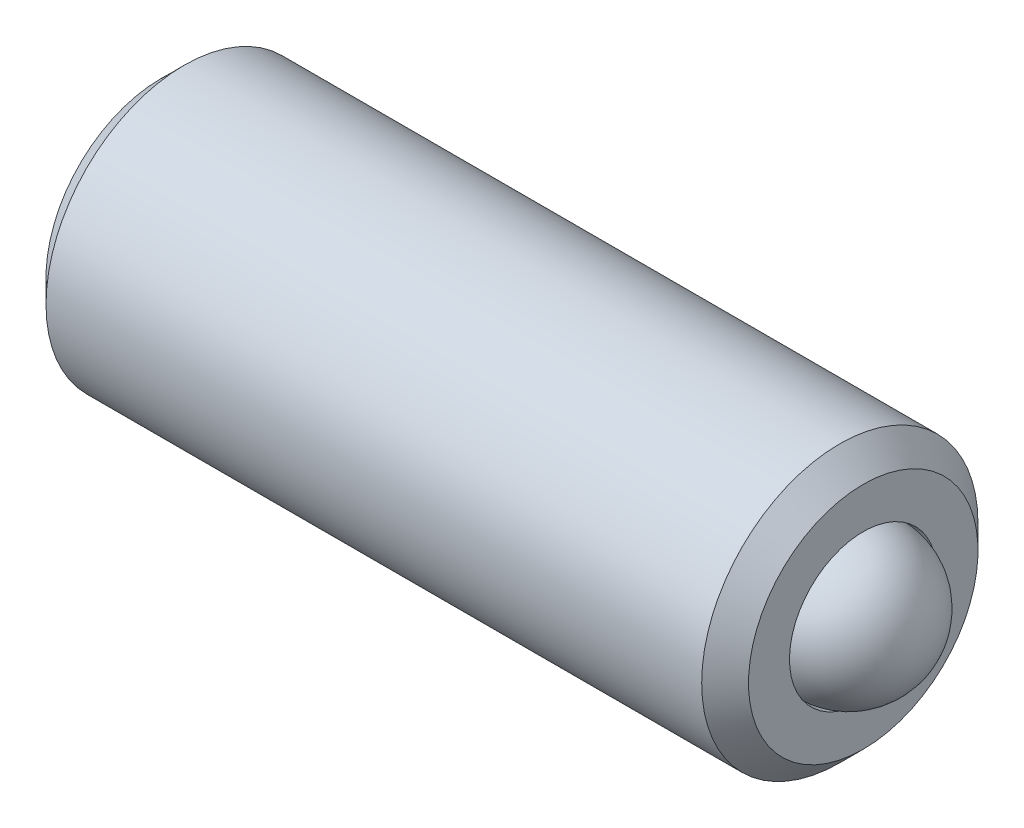
ISO-10303-21;
HEADER;
FILE_DESCRIPTION(('STEP AP214'),'2;1');
FILE_NAME('part.step','',(''),(''),'','','');
FILE_SCHEMA(('AUTOMOTIVE_DESIGN { 1 0 10303 214 1 1 1 1 }'));
ENDSEC;
DATA;
#1=APPLICATION_CONTEXT('core data for automotive mechanical design processes');
#2=APPLICATION_PROTOCOL_DEFINITION('international standard','automotive_design',2000,#1);
#3=PRODUCT_CONTEXT('',#1,'mechanical');
#4=PRODUCT('Part','Part','',(#3));
#5=PRODUCT_RELATED_PRODUCT_CATEGORY('part','',(#4));
#6=PRODUCT_DEFINITION_FORMATION('','',#4);
#7=PRODUCT_DEFINITION_CONTEXT('part definition',#1,'design');
#8=PRODUCT_DEFINITION('design','',#6,#7);
#9=PRODUCT_DEFINITION_SHAPE('','',#8);
#10=(LENGTH_UNIT() NAMED_UNIT(*) SI_UNIT(.MILLI.,.METRE.));
#11=(NAMED_UNIT(*) PLANE_ANGLE_UNIT() SI_UNIT($,.RADIAN.));
#12=(NAMED_UNIT(*) SI_UNIT($,.STERADIAN.) SOLID_ANGLE_UNIT());
#13=UNCERTAINTY_MEASURE_WITH_UNIT(LENGTH_MEASURE(1.E-05),#10,'distance_accuracy_value','');
#14=(GEOMETRIC_REPRESENTATION_CONTEXT(3) GLOBAL_UNCERTAINTY_ASSIGNED_CONTEXT((#13)) GLOBAL_UNIT_ASSIGNED_CONTEXT((#10,
#11,#12)) REPRESENTATION_CONTEXT('',''));
#15=CARTESIAN_POINT('',(0.,0.,0.));
#16=DIRECTION('',(0.,0.,1.));
#17=DIRECTION('',(1.,0.,0.));
#18=AXIS2_PLACEMENT_3D('',#15,#16,#17);
#19=CARTESIAN_POINT('',(-23.4649161282804,16.7837039818437,-1.19850984208369));
#20=DIRECTION('',(1.,0.,0.));
#21=DIRECTION('',(0.,1.,0.));
#22=AXIS2_PLACEMENT_3D('',#19,#20,#21);
#23=PLANE('',#22);
#24=CARTESIAN_POINT('',(-23.4649161282804,16.7837039818437,-1.19850984208371));
#25=DIRECTION('',(-1.,0.,0.));
#26=DIRECTION('',(0.,0.,1.));
#27=AXIS2_PLACEMENT_3D('',#24,#25,#26);
#28=CIRCLE('',#27,0.952500000000023);
#29=CARTESIAN_POINT('',(-23.4649161282804,16.7837039818437,-0.246009842083686));
#30=VERTEX_POINT('',#29);
#31=EDGE_CURVE('P0_E142',#30,#30,#28,.T.);
#32=ORIENTED_EDGE('',*,*,#31,.F.);
#33=EDGE_LOOP('',(#32));
#34=FACE_BOUND('',#33,.T.);
#35=CARTESIAN_POINT('',(-23.4649161282804,16.7837039818437,-1.19850984208369));
#36=DIRECTION('',(-1.,0.,0.));
#37=DIRECTION('',(0.,-1.,0.));
#38=AXIS2_PLACEMENT_3D('',#35,#36,#37);
#39=CIRCLE('',#38,1.24460000000001);
#40=CARTESIAN_POINT('',(-23.4649161282804,15.5391039818437,-1.19850984208369));
#41=VERTEX_POINT('',#40);
#42=EDGE_CURVE('P0_E29',#41,#41,#39,.T.);
#43=ORIENTED_EDGE('',*,*,#42,.T.);
#44=EDGE_LOOP('',(#43));
#45=FACE_BOUND('',#44,.T.);
#46=ADVANCED_FACE('P0_F17',(#34,#45),#23,.F.);
#47=CARTESIAN_POINT('',(-23.2109161282804,16.7837039818437,-1.19850984208369));
#48=DIRECTION('',(1.,0.,0.));
#49=DIRECTION('',(0.,1.,0.));
#50=AXIS2_PLACEMENT_3D('',#47,#48,#49);
#51=CONICAL_SURFACE('',#50,1.49860000000002,0.785398163397501);
#52=ORIENTED_EDGE('',*,*,#42,.F.);
#53=EDGE_LOOP('',(#52));
#54=FACE_BOUND('',#53,.T.);
#55=CARTESIAN_POINT('',(-23.2109161282804,16.7837039818437,-1.19850984208369));
#56=DIRECTION('',(-1.,0.,0.));
#57=DIRECTION('',(0.,-1.,0.));
#58=AXIS2_PLACEMENT_3D('',#55,#56,#57);
#59=CIRCLE('',#58,1.49860000000002);
#60=CARTESIAN_POINT('',(-23.2109161282804,15.2851039818437,-1.19850984208369));
#61=VERTEX_POINT('',#60);
#62=EDGE_CURVE('P0_E112',#61,#61,#59,.T.);
#63=ORIENTED_EDGE('',*,*,#62,.T.);
#64=EDGE_LOOP('',(#63));
#65=FACE_BOUND('',#64,.T.);
#66=ADVANCED_FACE('P0_F118',(#54,#65),#51,.T.);
#67=CARTESIAN_POINT('',(-23.4649161282804,16.7837039818437,-1.19850984208369));
#68=DIRECTION('',(-1.,0.,0.));
#69=DIRECTION('',(0.,-1.,0.));
#70=AXIS2_PLACEMENT_3D('',#67,#68,#69);
#71=CYLINDRICAL_SURFACE('',#70,1.49860000000001);
#72=CARTESIAN_POINT('',(-16.0989161282804,16.7837039818437,-1.19850984208369));
#73=DIRECTION('',(-1.,0.,0.));
#74=DIRECTION('',(0.,-1.,0.));
#75=AXIS2_PLACEMENT_3D('',#72,#73,#74);
#76=CIRCLE('',#75,1.49860000000001);
#77=CARTESIAN_POINT('',(-16.0989161282804,15.2851039818437,-1.19850984208369));
#78=VERTEX_POINT('',#77);
#79=EDGE_CURVE('P0_E109',#78,#78,#76,.T.);
#80=ORIENTED_EDGE('',*,*,#79,.T.);
#81=EDGE_LOOP('',(#80));
#82=FACE_BOUND('',#81,.T.);
#83=ORIENTED_EDGE('',*,*,#62,.F.);
#84=EDGE_LOOP('',(#83));
#85=FACE_BOUND('',#84,.T.);
#86=ADVANCED_FACE('P0_F121',(#82,#85),#71,.T.);
#87=CARTESIAN_POINT('',(-16.0989161282804,16.7837039818437,-1.19850984208369));
#88=DIRECTION('',(-1.,0.,0.));
#89=DIRECTION('',(0.,-1.,0.));
#90=AXIS2_PLACEMENT_3D('',#87,#88,#89);
#91=CONICAL_SURFACE('',#90,1.49860000000001,0.785398163397452);
#92=CARTESIAN_POINT('',(-15.8449161282804,16.7837039818437,-1.19850984208369));
#93=DIRECTION('',(-1.,0.,0.));
#94=DIRECTION('',(0.,-1.,0.));
#95=AXIS2_PLACEMENT_3D('',#92,#93,#94);
#96=CIRCLE('',#95,1.24460000000001);
#97=CARTESIAN_POINT('',(-15.8449161282804,15.5391039818437,-1.19850984208369));
#98=VERTEX_POINT('',#97);
#99=EDGE_CURVE('P0_E106',#98,#98,#96,.T.);
#100=ORIENTED_EDGE('',*,*,#99,.T.);
#101=EDGE_LOOP('',(#100));
#102=FACE_BOUND('',#101,.T.);
#103=ORIENTED_EDGE('',*,*,#79,.F.);
#104=EDGE_LOOP('',(#103));
#105=FACE_BOUND('',#104,.T.);
#106=ADVANCED_FACE('P0_F125',(#102,#105),#91,.T.);
#107=CARTESIAN_POINT('',(-15.8449161282804,16.783703981844,-1.19850984208369));
#108=DIRECTION('',(1.,0.,0.));
#109=DIRECTION('',(0.,1.,0.));
#110=AXIS2_PLACEMENT_3D('',#107,#108,#109);
#111=PLANE('',#110);
#112=CARTESIAN_POINT('',(-15.8449161282804,16.7837039818437,-1.19850984208369));
#113=DIRECTION('',(-1.,0.,0.));
#114=DIRECTION('',(0.,-1.,0.));
#115=AXIS2_PLACEMENT_3D('',#112,#113,#114);
#116=CIRCLE('',#115,0.800100000000028);
#117=CARTESIAN_POINT('',(-15.8449161282804,15.9836039818437,-1.19850984208369));
#118=VERTEX_POINT('',#117);
#119=EDGE_CURVE('P0_E103',#118,#118,#116,.T.);
#120=ORIENTED_EDGE('',*,*,#119,.T.);
#121=EDGE_LOOP('',(#120));
#122=FACE_BOUND('',#121,.T.);
#123=ORIENTED_EDGE('',*,*,#99,.F.);
#124=EDGE_LOOP('',(#123));
#125=FACE_BOUND('',#124,.T.);
#126=ADVANCED_FACE('P0_F132',(#122,#125),#111,.T.);
#127=CARTESIAN_POINT('',(-23.4649161282804,16.7837039818437,-1.19850984208369));
#128=DIRECTION('',(-1.,0.,0.));
#129=DIRECTION('',(0.,-1.,0.));
#130=AXIS2_PLACEMENT_3D('',#127,#128,#129);
#131=CYLINDRICAL_SURFACE('',#130,0.80010000000002);
#132=CARTESIAN_POINT('',(-16.3260981434141,16.7837039818437,-1.19850984208369));
#133=DIRECTION('',(-1.,0.,0.));
#134=DIRECTION('',(0.,-1.,0.));
#135=AXIS2_PLACEMENT_3D('',#132,#133,#134);
#136=CIRCLE('',#135,0.800100000000012);
#137=CARTESIAN_POINT('',(-16.3260981434141,15.9836039818437,-1.19850984208369));
#138=VERTEX_POINT('',#137);
#139=EDGE_CURVE('P0_E100',#138,#138,#136,.T.);
#140=ORIENTED_EDGE('',*,*,#139,.T.);
#141=EDGE_LOOP('',(#140));
#142=FACE_BOUND('',#141,.T.);
#143=ORIENTED_EDGE('',*,*,#119,.F.);
#144=EDGE_LOOP('',(#143));
#145=FACE_BOUND('',#144,.T.);
#146=ADVANCED_FACE('P0_F237',(#142,#145),#131,.F.);
#147=CARTESIAN_POINT('',(-16.3260981434141,16.7837039818437,-1.19850984208369));
#148=DIRECTION('',(1.,0.,0.));
#149=DIRECTION('',(0.,1.,0.));
#150=AXIS2_PLACEMENT_3D('',#147,#148,#149);
#151=CONICAL_SURFACE('',#150,0.800100000000012,0.785398163397454);
#152=CARTESIAN_POINT('',(-17.1261981434141,16.7837039818437,-1.19850984208369));
#153=VERTEX_POINT('',#152);
#154=VERTEX_LOOP('',#153);
#155=FACE_BOUND('',#154,.T.);
#156=ORIENTED_EDGE('',*,*,#139,.F.);
#157=EDGE_LOOP('',(#156));
#158=FACE_BOUND('',#157,.T.);
#159=ADVANCED_FACE('P0_F163',(#155,#158),#151,.F.);
#160=CARTESIAN_POINT('',(-23.4649161282804,16.7837039818437,-1.19850984208371));
#161=DIRECTION('',(-1.,0.,0.));
#162=DIRECTION('',(0.,0.,1.));
#163=AXIS2_PLACEMENT_3D('',#160,#161,#162);
#164=CONICAL_SURFACE('',#163,0.952500000000023,0.78539816339745);
#165=ORIENTED_EDGE('',*,*,#31,.T.);
#166=EDGE_LOOP('',(#165));
#167=FACE_BOUND('',#166,.T.);
#168=CARTESIAN_POINT('',(-23.2618316250217,17.5331194518975,-1.19870984208371));
#169=CARTESIAN_POINT('',(-23.2489550419246,17.520235010343,-1.176393334684));
#170=CARTESIAN_POINT('',(-23.2368331220587,17.5071359403417,-1.15370507990997));
#171=CARTESIAN_POINT('',(-23.2146373575626,17.4804251777366,-1.10744068196904));
#172=CARTESIAN_POINT('',(-23.2045758749636,17.466810940165,-1.0838601307886));
#173=CARTESIAN_POINT('',(-23.1873423052965,17.4393566827924,-1.03630796213526));
#174=CARTESIAN_POINT('',(-23.180126821193,17.4255236945623,-1.01234852370026));
#175=CARTESIAN_POINT('',(-23.1690006814042,17.3975597645173,-0.963913576082889));
#176=CARTESIAN_POINT('',(-23.1650817387919,17.3834296619056,-0.939439520443362));
#177=CARTESIAN_POINT('',(-23.1601097937295,17.3489157595999,-0.87965968808239));
#178=CARTESIAN_POINT('',(-23.1610093299175,17.3284513433023,-0.844214279307727));
#179=CARTESIAN_POINT('',(-23.1702778713378,17.2879514682883,-0.774066438083356));
#180=CARTESIAN_POINT('',(-23.178658030564,17.2679166958897,-0.739365194370872));
#181=CARTESIAN_POINT('',(-23.1988671069507,17.2327316410986,-0.678422891805566));
#182=CARTESIAN_POINT('',(-23.2096418298755,17.2174196006326,-0.651901659750851));
#183=CARTESIAN_POINT('',(-23.2339147438423,17.1873954837112,-0.599898363790611));
#184=CARTESIAN_POINT('',(-23.2474040758273,17.1726816381242,-0.57441323565922));
#185=CARTESIAN_POINT('',(-23.2618316250217,17.1582385117899,-0.549397007028016));
#186=B_SPLINE_CURVE_WITH_KNOTS('',3,(#168,#169,#170,#171,#172,#173,#174,#175,#176,#177,#178,
#179,#180,#181,#182,#183,#184,#185),.UNSPECIFIED.,.F.,.F.,(4,2,2,2,2,2,2,2,4),(0.,
0.0864788641253346,0.173462284806165,0.259062693136953,0.344447268473231,0.466486555643647,
0.588708114182826,0.685962692863729,0.782904885826139),.UNSPECIFIED.);
#187=CARTESIAN_POINT('',(-23.2617161282804,17.5330039818437,-1.19850984208371));
#188=VERTEX_POINT('',#187);
#189=CARTESIAN_POINT('',(-23.2617161282804,17.1583539818437,-0.549597007028016));
#190=VERTEX_POINT('',#189);
#191=EDGE_CURVE('P0_E85',#188,#190,#186,.T.);
#192=ORIENTED_EDGE('',*,*,#191,.T.);
#193=CARTESIAN_POINT('',(-24.9739553494203,14.4092382588419,-0.549597007028115));
#194=CARTESIAN_POINT('',(-24.9162129079446,14.4691033455408,-0.549597007028112));
#195=CARTESIAN_POINT('',(-24.8585439739931,14.5290396665799,-0.54959700702811));
#196=CARTESIAN_POINT('',(-24.7434021511429,14.649106411897,-0.549597007028106));
#197=CARTESIAN_POINT('',(-24.6859292728778,14.7092368463697,-0.549597007028104));
#198=CARTESIAN_POINT('',(-24.5710755159701,14.8299043845783,-0.5495970070281));
#199=CARTESIAN_POINT('',(-24.5136953360286,14.8904421539257,-0.549597007028097));
#200=CARTESIAN_POINT('',(-24.399269980978,15.011829083006,-0.549597007028093));
#201=CARTESIAN_POINT('',(-24.3422247921954,15.072678229837,-0.549597007028091));
#202=CARTESIAN_POINT('',(-24.2214398193986,15.2024673823265,-0.549597007028086));
#203=CARTESIAN_POINT('',(-24.1577597667731,15.2714630567787,-0.549597007028084));
#204=CARTESIAN_POINT('',(-24.0312123536207,15.4102162971048,-0.549597007028079));
#205=CARTESIAN_POINT('',(-23.9683451058613,15.4799739662717,-0.549597007028076));
#206=CARTESIAN_POINT('',(-23.8439836993196,15.6204955025999,-0.549597007028071));
#207=CARTESIAN_POINT('',(-23.7824874051301,15.6912574759963,-0.549597007028069));
#208=CARTESIAN_POINT('',(-23.6615623401077,15.8345183539173,-0.549597007028063));
#209=CARTESIAN_POINT('',(-23.6021329434736,15.907016721282,-0.549597007028061));
#210=CARTESIAN_POINT('',(-23.509830832673,16.0257286746345,-0.549597007028057));
#211=CARTESIAN_POINT('',(-23.475750966889,16.0709975950446,-0.549597007028055));
#212=CARTESIAN_POINT('',(-23.4096818275872,16.1631876081487,-0.549597007028052));
#213=CARTESIAN_POINT('',(-23.3776964948896,16.210111573325,-0.54959700702805));
#214=CARTESIAN_POINT('',(-23.3178434019184,16.3051971368088,-0.549597007028046));
#215=CARTESIAN_POINT('',(-23.2899040535273,16.3533129415812,-0.549597007028045));
#216=CARTESIAN_POINT('',(-23.239767267835,16.4523935062724,-0.549597007028041));
#217=CARTESIAN_POINT('',(-23.2175477949664,16.5033463842668,-0.549597007028039));
#218=CARTESIAN_POINT('',(-23.1894545225992,16.5882243165813,-0.549597007028036));
#219=CARTESIAN_POINT('',(-23.1805819443804,16.6211292705176,-0.549597007028035));
#220=CARTESIAN_POINT('',(-23.1675643455832,16.6878051475961,-0.549597007028033));
#221=CARTESIAN_POINT('',(-23.1634064012769,16.7215734427071,-0.549597007028032));
#222=CARTESIAN_POINT('',(-23.1601505509814,16.7969829350093,-0.549597007028029));
#223=CARTESIAN_POINT('',(-23.1623971423535,16.838690764715,-0.549597007028027));
#224=CARTESIAN_POINT('',(-23.174443016596,16.9211060234123,-0.549597007028024));
#225=CARTESIAN_POINT('',(-23.1842754469344,16.9618082505968,-0.549597007028023));
#226=CARTESIAN_POINT('',(-23.2069699068764,17.0331400633901,-0.549597007028021));
#227=CARTESIAN_POINT('',(-23.2187933081849,17.0641199396153,-0.549597007028019));
#228=CARTESIAN_POINT('',(-23.2450738167802,17.1249550446671,-0.549597007028017));
#229=CARTESIAN_POINT('',(-23.2595330925753,17.1548093228879,-0.549597007028016));
#230=CARTESIAN_POINT('',(-23.2905091691146,17.2137940974906,-0.549597007028014));
#231=CARTESIAN_POINT('',(-23.3070450759384,17.2429143879802,-0.549597007028013));
#232=CARTESIAN_POINT('',(-23.3415231399447,17.300284022785,-0.549597007028011));
#233=CARTESIAN_POINT('',(-23.3594646750901,17.3285337447299,-0.54959700702801));
#234=CARTESIAN_POINT('',(-23.40131834725,17.3917860148084,-0.549597007028008));
#235=CARTESIAN_POINT('',(-23.4255459796205,17.4265785474448,-0.549597007028006));
#236=CARTESIAN_POINT('',(-23.4751814387298,17.4953149964402,-0.549597007028004));
#237=CARTESIAN_POINT('',(-23.5005895310987,17.5292587191286,-0.549597007028003));
#238=CARTESIAN_POINT('',(-23.5781145284378,17.6301676661983,-0.549597007027999));
#239=CARTESIAN_POINT('',(-23.6314956988711,17.6961579522711,-0.549597007027997));
#240=CARTESIAN_POINT('',(-23.7403321741694,17.8267644745017,-0.549597007027992));
#241=CARTESIAN_POINT('',(-23.7957939890199,17.8913751958962,-0.54959700702799));
#242=CARTESIAN_POINT('',(-23.9078926498964,18.019515077058,-0.549597007027985));
#243=CARTESIAN_POINT('',(-23.9645289499814,18.0830447154095,-0.549597007027983));
#244=CARTESIAN_POINT('',(-24.072285343644,18.2023946041017,-0.549597007027978));
#245=CARTESIAN_POINT('',(-24.1233224427375,18.2582901317845,-0.549597007027977));
#246=CARTESIAN_POINT('',(-24.2258613748827,18.3696671015383,-0.549597007027972));
#247=CARTESIAN_POINT('',(-24.2773632706748,18.4251484858022,-0.54959700702797));
#248=CARTESIAN_POINT('',(-24.3803629969416,18.5354242880679,-0.549597007027967));
#249=CARTESIAN_POINT('',(-24.4318585676312,18.5902208201663,-0.549597007027965));
#250=CARTESIAN_POINT('',(-24.5351036908169,18.6995570184242,-0.549597007027961));
#251=CARTESIAN_POINT('',(-24.5868531998021,18.7540967256527,-0.549597007027959));
#252=CARTESIAN_POINT('',(-24.6386973535117,18.8085456994283,-0.549597007027957));
#253=B_SPLINE_CURVE_WITH_KNOTS('',3,(#193,#194,#195,#196,#197,#198,#199,#200,#201,#202,#203,
#204,#205,#206,#207,#208,#209,#210,#211,#212,#213,#214,#215,#216,#217,#218,#219,#220,#221,#222,
#223,#224,#225,#226,#227,#228,#229,#230,#231,#232,#233,#234,#235,#236,#237,#238,#239,#240,#241,
#242,#243,#244,#245,#246,#247,#248,#249,#250,#251,#252),.UNSPECIFIED.,.F.,.F.,(4,2,2,2,2,2,2,2,
2,2,2,2,2,2,2,2,2,2,2,2,2,2,2,2,2,2,2,2,2,4),(0.,0.249524170139364,0.499061665439864,
0.749292128124689,0.999512305079418,1.28118188807046,1.56289013898527,1.84412365169307,
2.125271259699,2.29522422965679,2.46548828307588,2.63222422694829,2.79830787602708,
2.90027530607566,3.0019625426852,3.12646325615384,3.25151109710588,3.35084711325208,
3.45026522403926,3.55067620936327,3.65104300779616,3.77819720609631,3.90538015687358,
4.15993807683352,4.41537266859039,4.67069107513106,4.89776066192222,5.12486137221031,
5.35044877184562,5.57599878142068),.UNSPECIFIED.);
#254=CARTESIAN_POINT('',(-23.2617161282804,16.4090539818437,-0.549597007028043));
#255=VERTEX_POINT('',#254);
#256=EDGE_CURVE('P0_E170',#190,#255,#253,.F.);
#257=ORIENTED_EDGE('',*,*,#256,.T.);
#258=CARTESIAN_POINT('',(-23.2618316250217,16.4091694518975,-0.549397007028043));
#259=CARTESIAN_POINT('',(-23.2489550419246,16.3962850103429,-0.571713514427752));
#260=CARTESIAN_POINT('',(-23.2368331220586,16.3831859403417,-0.594401769201784));
#261=CARTESIAN_POINT('',(-23.2146373575626,16.3564751777366,-0.640666167142707));
#262=CARTESIAN_POINT('',(-23.2045758749636,16.342860940165,-0.664246718323149));
#263=CARTESIAN_POINT('',(-23.1873423052965,16.3154066827924,-0.711798886976482));
#264=CARTESIAN_POINT('',(-23.180126821193,16.3015736945623,-0.735758325411486));
#265=CARTESIAN_POINT('',(-23.1690006814042,16.2736097645172,-0.784193273028851));
#266=CARTESIAN_POINT('',(-23.1650817387919,16.2594796619056,-0.808667328668378));
#267=CARTESIAN_POINT('',(-23.1601097937295,16.2249657595999,-0.868447161029349));
#268=CARTESIAN_POINT('',(-23.1610093299174,16.2045013433023,-0.90389256980401));
#269=CARTESIAN_POINT('',(-23.1702778713377,16.1640014682883,-0.974040411028379));
#270=CARTESIAN_POINT('',(-23.178658030564,16.1439666958897,-1.00874165474086));
#271=CARTESIAN_POINT('',(-23.1988671069506,16.1087816410986,-1.06968395730617));
#272=CARTESIAN_POINT('',(-23.2096418298755,16.0934696006326,-1.09620518936089));
#273=CARTESIAN_POINT('',(-23.2339147438423,16.0634454837112,-1.14820848532113));
#274=CARTESIAN_POINT('',(-23.2474040758273,16.0487316381242,-1.17369361345252));
#275=CARTESIAN_POINT('',(-23.2618316250217,16.0342885117899,-1.19870984208372));
#276=B_SPLINE_CURVE_WITH_KNOTS('',3,(#258,#259,#260,#261,#262,#263,#264,#265,#266,#267,#268,
#269,#270,#271,#272,#273,#274,#275),.UNSPECIFIED.,.F.,.F.,(4,2,2,2,2,2,2,2,4),(0.,
0.086478864125331,0.173462284806158,0.25906269313694,0.344447268473215,0.466486555643629,
0.588708114182806,0.685962692863711,0.782904885826126),.UNSPECIFIED.);
#277=CARTESIAN_POINT('',(-23.2617161282804,16.0344039818437,-1.19850984208372));
#278=VERTEX_POINT('',#277);
#279=EDGE_CURVE('P0_E145',#255,#278,#276,.T.);
#280=ORIENTED_EDGE('',*,*,#279,.T.);
#281=CARTESIAN_POINT('',(-23.2618316250217,16.4091694518975,-1.8476226771394));
#282=CARTESIAN_POINT('',(-23.2489550419246,16.3962850103429,-1.82530616973969));
#283=CARTESIAN_POINT('',(-23.2368331220587,16.3831859403417,-1.80261791496566));
#284=CARTESIAN_POINT('',(-23.2146373575626,16.3564751777366,-1.75635351702473));
#285=CARTESIAN_POINT('',(-23.2045758749636,16.342860940165,-1.73277296584429));
#286=CARTESIAN_POINT('',(-23.1873423052965,16.3154066827924,-1.68522079719095));
#287=CARTESIAN_POINT('',(-23.180126821193,16.3015736945623,-1.66126135875595));
#288=CARTESIAN_POINT('',(-23.1690006814042,16.2736097645172,-1.61282641113858));
#289=CARTESIAN_POINT('',(-23.1650817387919,16.2594796619056,-1.58835235549905));
#290=CARTESIAN_POINT('',(-23.1601097937295,16.2249657595999,-1.52857252313808));
#291=CARTESIAN_POINT('',(-23.1610093299175,16.2045013433023,-1.49312711436342));
#292=CARTESIAN_POINT('',(-23.1702778713378,16.1640014682883,-1.42297927313905));
#293=CARTESIAN_POINT('',(-23.178658030564,16.1439666958897,-1.38827802942656));
#294=CARTESIAN_POINT('',(-23.1988671069507,16.1087816410986,-1.32733572686126));
#295=CARTESIAN_POINT('',(-23.2096418298755,16.0934696006326,-1.30081449480655));
#296=CARTESIAN_POINT('',(-23.2339147438423,16.0634454837112,-1.24881119884631));
#297=CARTESIAN_POINT('',(-23.2474040758273,16.0487316381242,-1.22332607071492));
#298=CARTESIAN_POINT('',(-23.2618316250217,16.0342885117899,-1.19830984208372));
#299=B_SPLINE_CURVE_WITH_KNOTS('',3,(#281,#282,#283,#284,#285,#286,#287,#288,#289,#290,#291,
#292,#293,#294,#295,#296,#297,#298),.UNSPECIFIED.,.F.,.F.,(4,2,2,2,2,2,2,2,4),(0.,
0.0864788641253366,0.173462284806167,0.259062693136956,0.344447268473237,0.466486555643652,
0.588708114182833,0.685962692863723,0.782904885826125),.UNSPECIFIED.);
#300=CARTESIAN_POINT('',(-23.2617161282804,16.4090539818437,-1.8474226771394));
#301=VERTEX_POINT('',#300);
#302=EDGE_CURVE('P0_E36',#301,#278,#299,.T.);
#303=ORIENTED_EDGE('',*,*,#302,.F.);
#304=CARTESIAN_POINT('',(-24.9739553472225,14.4092382611204,-1.8474226771394));
#305=CARTESIAN_POINT('',(-24.9162129059096,14.4691033476544,-1.8474226771394));
#306=CARTESIAN_POINT('',(-24.8585439721208,14.5290396685284,-1.8474226771394));
#307=CARTESIAN_POINT('',(-24.7434021495955,14.6491064135146,-1.8474226771394));
#308=CARTESIAN_POINT('',(-24.6859292714925,14.7092368478215,-1.8474226771394));
#309=CARTESIAN_POINT('',(-24.5710755149099,14.8299043856958,-1.8474226771394));
#310=CARTESIAN_POINT('',(-24.5136953351313,14.8904421548747,-1.8474226771394));
#311=CARTESIAN_POINT('',(-24.399269980405,15.0118290836167,-1.8474226771394));
#312=CARTESIAN_POINT('',(-24.3422247917839,15.0726782302779,-1.8474226771394));
#313=CARTESIAN_POINT('',(-24.2214398193327,15.2024673823989,-1.8474226771394));
#314=CARTESIAN_POINT('',(-24.1577597668909,15.2714630566522,-1.8474226771394));
#315=CARTESIAN_POINT('',(-24.0312123541011,15.4102162965755,-1.8474226771394));
#316=CARTESIAN_POINT('',(-23.9683451065205,15.4799739655385,-1.8474226771394));
#317=CARTESIAN_POINT('',(-23.8439837003258,15.6204955014512,-1.8474226771394));
#318=CARTESIAN_POINT('',(-23.7824874063046,15.6912574746361,-1.8474226771394));
#319=CARTESIAN_POINT('',(-23.6615623415992,15.8345183521184,-1.8474226771394));
#320=CARTESIAN_POINT('',(-23.6021329451138,15.9070167192559,-1.8474226771394));
#321=CARTESIAN_POINT('',(-23.5098308342282,16.0257286725845,-1.8474226771394));
#322=CARTESIAN_POINT('',(-23.4757509682368,16.0709975932174,-1.8474226771394));
#323=CARTESIAN_POINT('',(-23.4096818285301,16.1631876067791,-1.8474226771394));
#324=CARTESIAN_POINT('',(-23.3776964956349,16.2101115721902,-1.8474226771394));
#325=CARTESIAN_POINT('',(-23.3178434023042,16.3051971361473,-1.8474226771394));
#326=CARTESIAN_POINT('',(-23.2899040537499,16.3533129411575,-1.8474226771394));
#327=CARTESIAN_POINT('',(-23.2397672677864,16.4523935063523,-1.8474226771394));
#328=CARTESIAN_POINT('',(-23.2175477948093,16.5033463846122,-1.8474226771394));
#329=CARTESIAN_POINT('',(-23.1894545224799,16.5882243170207,-1.8474226771394));
#330=CARTESIAN_POINT('',(-23.1805819443308,16.6211292707621,-1.8474226771394));
#331=CARTESIAN_POINT('',(-23.1675643456154,16.6878051474405,-1.8474226771394));
#332=CARTESIAN_POINT('',(-23.1634064013217,16.7215734423463,-1.8474226771394));
#333=CARTESIAN_POINT('',(-23.1601505509629,16.7969829346193,-1.8474226771394));
#334=CARTESIAN_POINT('',(-23.1623971423253,16.8386907645058,-1.8474226771394));
#335=CARTESIAN_POINT('',(-23.1744430166147,16.9211060235566,-1.8474226771394));
#336=CARTESIAN_POINT('',(-23.1842754470103,16.9618082509138,-1.8474226771394));
#337=CARTESIAN_POINT('',(-23.2069699070618,17.0331400639103,-1.8474226771394));
#338=CARTESIAN_POINT('',(-23.2187933084053,17.0641199401727,-1.8474226771394));
#339=CARTESIAN_POINT('',(-23.2450738170725,17.1249550452963,-1.8474226771394));
#340=CARTESIAN_POINT('',(-23.2595330929045,17.1548093235518,-1.8474226771394));
#341=CARTESIAN_POINT('',(-23.2905091695181,17.2137940982216,-1.8474226771394));
#342=CARTESIAN_POINT('',(-23.3070450763792,17.2429143887436,-1.8474226771394));
#343=CARTESIAN_POINT('',(-23.34152314046,17.3002840236126,-1.8474226771394));
#344=CARTESIAN_POINT('',(-23.3594646756426,17.3285337455893,-1.8474226771394));
#345=CARTESIAN_POINT('',(-23.4013183479,17.3917860157598,-1.8474226771394));
#346=CARTESIAN_POINT('',(-23.4255459803317,17.4265785484558,-1.8474226771394));
#347=CARTESIAN_POINT('',(-23.4751814395639,17.4953149975694,-1.8474226771394));
#348=CARTESIAN_POINT('',(-23.5005895319945,17.5292587203164,-1.8474226771394));
#349=CARTESIAN_POINT('',(-23.5781145295189,17.6301676675611,-1.8474226771394));
#350=CARTESIAN_POINT('',(-23.6314957000758,17.6961579537496,-1.8474226771394));
#351=CARTESIAN_POINT('',(-23.7403321756208,17.8267644762111,-1.8474226771394));
#352=CARTESIAN_POINT('',(-23.7957939905943,17.8913751977209,-1.8474226771394));
#353=CARTESIAN_POINT('',(-23.9078926517162,18.0195150791134,-1.8474226771394));
#354=CARTESIAN_POINT('',(-23.9645289519235,18.0830447175803,-1.8474226771394));
#355=CARTESIAN_POINT('',(-24.0722853458188,18.2023946064932,-1.8474226771394));
#356=CARTESIAN_POINT('',(-24.1233224450228,18.2582901342812,-1.8474226771394));
#357=CARTESIAN_POINT('',(-24.2258613773886,18.3696671042457,-1.8474226771394));
#358=CARTESIAN_POINT('',(-24.2773632732907,18.425148488615,-1.8474226771394));
#359=CARTESIAN_POINT('',(-24.3803629997777,18.5354242910922,-1.8474226771394));
#360=CARTESIAN_POINT('',(-24.4318585705773,18.5902208232967,-1.8474226771394));
#361=CARTESIAN_POINT('',(-24.5351036939828,18.6995570217668,-1.8474226771394));
#362=CARTESIAN_POINT('',(-24.5868532030778,18.7540967291015,-1.8474226771394));
#363=CARTESIAN_POINT('',(-24.6386973568971,18.8085457029833,-1.8474226771394));
#364=B_SPLINE_CURVE_WITH_KNOTS('',3,(#304,#305,#306,#307,#308,#309,#310,#311,#312,#313,#314,
#315,#316,#317,#318,#319,#320,#321,#322,#323,#324,#325,#326,#327,#328,#329,#330,#331,#332,#333,
#334,#335,#336,#337,#338,#339,#340,#341,#342,#343,#344,#345,#346,#347,#348,#349,#350,#351,#352,
#353,#354,#355,#356,#357,#358,#359,#360,#361,#362,#363),.UNSPECIFIED.,.F.,.F.,(4,2,2,2,2,2,2,2,
2,2,2,2,2,2,2,2,2,2,2,2,2,2,2,2,2,2,2,2,2,4),(0.,0.249524169444003,0.499061664048886,
0.7492921260306,0.999512302282453,1.28118188446102,1.56289013456251,1.84412364646026,
2.125271253658,2.29522422452394,2.46548827885783,2.63222422359163,2.79830787351792,
2.9002753029521,3.00196253895413,3.12646325295126,3.25151109444025,3.35084711072833,
3.4502652216572,3.55067620712132,3.65104300569431,3.7781972042461,3.90538015527503,
4.15993807573828,4.41537266799792,4.67069107504134,4.89776066228907,5.12486137303373,
5.35044877312689,5.5759987831598),.UNSPECIFIED.);
#365=CARTESIAN_POINT('',(-23.2617161282804,17.1583539818437,-1.8474226771394));
#366=VERTEX_POINT('',#365);
#367=EDGE_CURVE('P0_E11',#366,#301,#364,.F.);
#368=ORIENTED_EDGE('',*,*,#367,.F.);
#369=CARTESIAN_POINT('',(-23.2618316250217,17.5331194518975,-1.19830984208371));
#370=CARTESIAN_POINT('',(-23.2489550419246,17.520235010343,-1.22062634948342));
#371=CARTESIAN_POINT('',(-23.2368331220587,17.5071359403417,-1.24331460425745));
#372=CARTESIAN_POINT('',(-23.2146373575626,17.4804251777366,-1.28957900219837));
#373=CARTESIAN_POINT('',(-23.2045758749636,17.466810940165,-1.31315955337882));
#374=CARTESIAN_POINT('',(-23.1873423052965,17.4393566827924,-1.36071172203215));
#375=CARTESIAN_POINT('',(-23.180126821193,17.4255236945623,-1.38467116046716));
#376=CARTESIAN_POINT('',(-23.1690006814042,17.3975597645173,-1.43310610808453));
#377=CARTESIAN_POINT('',(-23.1650817387919,17.3834296619056,-1.45758016372405));
#378=CARTESIAN_POINT('',(-23.1601097937295,17.3489157595999,-1.51735999608503));
#379=CARTESIAN_POINT('',(-23.1610093299175,17.3284513433023,-1.55280540485969));
#380=CARTESIAN_POINT('',(-23.1702778713378,17.2879514682883,-1.62295324608406));
#381=CARTESIAN_POINT('',(-23.178658030564,17.2679166958897,-1.65765448979654));
#382=CARTESIAN_POINT('',(-23.1988671069507,17.2327316410986,-1.71859679236185));
#383=CARTESIAN_POINT('',(-23.2096418298755,17.2174196006326,-1.74511802441657));
#384=CARTESIAN_POINT('',(-23.2339147438423,17.1873954837112,-1.79712132037681));
#385=CARTESIAN_POINT('',(-23.2474040758273,17.1726816381242,-1.8226064485082));
#386=CARTESIAN_POINT('',(-23.2618316250217,17.1582385117899,-1.8476226771394));
#387=B_SPLINE_CURVE_WITH_KNOTS('',3,(#369,#370,#371,#372,#373,#374,#375,#376,#377,#378,#379,
#380,#381,#382,#383,#384,#385,#386),.UNSPECIFIED.,.F.,.F.,(4,2,2,2,2,2,2,2,4),(0.,
0.0864788641253344,0.173462284806165,0.259062693136952,0.344447268473231,0.466486555643647,
0.588708114182827,0.685962692863728,0.782904885826141),.UNSPECIFIED.);
#388=EDGE_CURVE('P0_E72',#188,#366,#387,.T.);
#389=ORIENTED_EDGE('',*,*,#388,.F.);
#390=EDGE_LOOP('',(#192,#257,#280,#303,#368,#389));
#391=FACE_BOUND('',#390,.T.);
#392=ADVANCED_FACE('P0_F71',(#167,#391),#164,.F.);
#393=CARTESIAN_POINT('',(-21.9409161282804,13.9041626256064,-1.19850984208369));
#394=DIRECTION('',(-1.,0.,0.));
#395=DIRECTION('',(0.,-1.,0.));
#396=AXIS2_PLACEMENT_3D('',#393,#394,#395);
#397=PLANE('',#396);
#398=DIRECTION('',(0.,-0.499999999999997,-0.866025403784441));
#399=VECTOR('',#398,1.);
#400=CARTESIAN_POINT('',(-21.9409161282804,16.6257936427844,-2.76984424248625));
#401=LINE('',#400,#399);
#402=CARTESIAN_POINT('',(-21.9409161282804,17.5330039818437,-1.19850984208371));
#403=VERTEX_POINT('',#402);
#404=CARTESIAN_POINT('',(-21.9409161282804,17.1583539818437,-1.8474226771394));
#405=VERTEX_POINT('',#404);
#406=EDGE_CURVE('P0_E84',#403,#405,#401,.T.);
#407=ORIENTED_EDGE('',*,*,#406,.T.);
#408=DIRECTION('',(0.,-1.,0.));
#409=VECTOR('',#408,1.);
#410=CARTESIAN_POINT('',(-21.9409161282804,13.9041626256064,-1.8474226771394));
#411=LINE('',#410,#409);
#412=CARTESIAN_POINT('',(-21.9409161282804,16.4090539818437,-1.8474226771394));
#413=VERTEX_POINT('',#412);
#414=EDGE_CURVE('P0_E89',#405,#413,#411,.T.);
#415=ORIENTED_EDGE('',*,*,#414,.T.);
#416=DIRECTION('',(0.,-0.5,0.866025403784439));
#417=VECTOR('',#416,1.);
#418=CARTESIAN_POINT('',(-21.9409161282804,15.5018436427844,-0.276088276736828));
#419=LINE('',#418,#417);
#420=CARTESIAN_POINT('',(-21.9409161282804,16.0344039818437,-1.19850984208372));
#421=VERTEX_POINT('',#420);
#422=EDGE_CURVE('P0_E219',#413,#421,#419,.T.);
#423=ORIENTED_EDGE('',*,*,#422,.T.);
#424=DIRECTION('',(0.,-0.5,-0.866025403784439));
#425=VECTOR('',#424,1.);
#426=CARTESIAN_POINT('',(-21.9409161282804,15.5018436427844,-2.12093140743057));
#427=LINE('',#426,#425);
#428=CARTESIAN_POINT('',(-21.9409161282804,16.4090539818437,-0.549597007028043));
#429=VERTEX_POINT('',#428);
#430=EDGE_CURVE('P0_E217',#429,#421,#427,.T.);
#431=ORIENTED_EDGE('',*,*,#430,.F.);
#432=DIRECTION('',(0.,-1.,0.));
#433=VECTOR('',#432,1.);
#434=CARTESIAN_POINT('',(-21.9409161282804,13.9041626256063,-0.549597007028133));
#435=LINE('',#434,#433);
#436=CARTESIAN_POINT('',(-21.9409161282804,17.1583539818437,-0.549597007028016));
#437=VERTEX_POINT('',#436);
#438=EDGE_CURVE('P0_E96',#437,#429,#435,.T.);
#439=ORIENTED_EDGE('',*,*,#438,.F.);
#440=DIRECTION('',(0.,-0.499999999999997,0.866025403784441));
#441=VECTOR('',#440,1.);
#442=CARTESIAN_POINT('',(-21.9409161282804,16.6257936427844,0.372824558318854));
#443=LINE('',#442,#441);
#444=EDGE_CURVE('P0_E92',#403,#437,#443,.T.);
#445=ORIENTED_EDGE('',*,*,#444,.F.);
#446=EDGE_LOOP('',(#407,#415,#423,#431,#439,#445));
#447=FACE_BOUND('',#446,.T.);
#448=ADVANCED_FACE('P0_F162',(#447),#397,.T.);
#449=CARTESIAN_POINT('',(-21.9409161282804,13.9041626256064,-1.8474226771394));
#450=DIRECTION('',(0.,0.,-1.));
#451=DIRECTION('',(-1.,0.,0.));
#452=AXIS2_PLACEMENT_3D('',#449,#450,#451);
#453=PLANE('',#452);
#454=DIRECTION('',(-1.,0.,0.));
#455=VECTOR('',#454,1.);
#456=CARTESIAN_POINT('',(-21.9409161282804,17.1583539818437,-1.8474226771394));
#457=LINE('',#456,#455);
#458=EDGE_CURVE('P0_E81',#405,#366,#457,.T.);
#459=ORIENTED_EDGE('',*,*,#458,.T.);
#460=ORIENTED_EDGE('',*,*,#367,.T.);
#461=DIRECTION('',(-1.,0.,0.));
#462=VECTOR('',#461,1.);
#463=CARTESIAN_POINT('',(-21.9409161282804,16.4090539818437,-1.8474226771394));
#464=LINE('',#463,#462);
#465=EDGE_CURVE('P0_E91',#413,#301,#464,.T.);
#466=ORIENTED_EDGE('',*,*,#465,.F.);
#467=ORIENTED_EDGE('',*,*,#414,.F.);
#468=EDGE_LOOP('',(#459,#460,#466,#467));
#469=FACE_BOUND('',#468,.T.);
#470=ADVANCED_FACE('P0_F87',(#469),#453,.F.);
#471=CARTESIAN_POINT('',(-21.9409161282804,15.5018436427844,-0.276088276736828));
#472=DIRECTION('',(0.,-0.866025403784439,-0.5));
#473=DIRECTION('',(0.,0.5,-0.866025403784439));
#474=AXIS2_PLACEMENT_3D('',#471,#472,#473);
#475=PLANE('',#474);
#476=ORIENTED_EDGE('',*,*,#465,.T.);
#477=ORIENTED_EDGE('',*,*,#302,.T.);
#478=DIRECTION('',(-1.,0.,0.));
#479=VECTOR('',#478,1.);
#480=CARTESIAN_POINT('',(-21.9409161282804,16.0344039818437,-1.19850984208372));
#481=LINE('',#480,#479);
#482=EDGE_CURVE('P0_E94',#421,#278,#481,.T.);
#483=ORIENTED_EDGE('',*,*,#482,.F.);
#484=ORIENTED_EDGE('',*,*,#422,.F.);
#485=EDGE_LOOP('',(#476,#477,#483,#484));
#486=FACE_BOUND('',#485,.T.);
#487=ADVANCED_FACE('P0_F157',(#486),#475,.F.);
#488=CARTESIAN_POINT('',(-21.9409161282804,15.5018436427844,-2.12093140743057));
#489=DIRECTION('',(0.,0.866025403784439,-0.5));
#490=DIRECTION('',(0.,0.5,0.866025403784439));
#491=AXIS2_PLACEMENT_3D('',#488,#489,#490);
#492=PLANE('',#491);
#493=ORIENTED_EDGE('',*,*,#279,.F.);
#494=DIRECTION('',(-1.,0.,0.));
#495=VECTOR('',#494,1.);
#496=CARTESIAN_POINT('',(-21.9409161282804,16.4090539818437,-0.549597007028043));
#497=LINE('',#496,#495);
#498=EDGE_CURVE('P0_E204',#429,#255,#497,.T.);
#499=ORIENTED_EDGE('',*,*,#498,.F.);
#500=ORIENTED_EDGE('',*,*,#430,.T.);
#501=ORIENTED_EDGE('',*,*,#482,.T.);
#502=EDGE_LOOP('',(#493,#499,#500,#501));
#503=FACE_BOUND('',#502,.T.);
#504=ADVANCED_FACE('P0_F191',(#503),#492,.T.);
#505=CARTESIAN_POINT('',(-21.9409161282804,13.9041626256063,-0.549597007028133));
#506=DIRECTION('',(0.,0.,-1.));
#507=DIRECTION('',(0.,1.,0.));
#508=AXIS2_PLACEMENT_3D('',#505,#506,#507);
#509=PLANE('',#508);
#510=ORIENTED_EDGE('',*,*,#256,.F.);
#511=DIRECTION('',(-1.,0.,0.));
#512=VECTOR('',#511,1.);
#513=CARTESIAN_POINT('',(-21.9409161282804,17.1583539818437,-0.549597007028016));
#514=LINE('',#513,#512);
#515=EDGE_CURVE('P0_E211',#437,#190,#514,.T.);
#516=ORIENTED_EDGE('',*,*,#515,.F.);
#517=ORIENTED_EDGE('',*,*,#438,.T.);
#518=ORIENTED_EDGE('',*,*,#498,.T.);
#519=EDGE_LOOP('',(#510,#516,#517,#518));
#520=FACE_BOUND('',#519,.T.);
#521=ADVANCED_FACE('P0_F187',(#520),#509,.T.);
#522=CARTESIAN_POINT('',(-21.9409161282804,16.6257936427844,0.372824558318854));
#523=DIRECTION('',(0.,-0.866025403784441,-0.499999999999997));
#524=DIRECTION('',(0.,0.499999999999997,-0.866025403784441));
#525=AXIS2_PLACEMENT_3D('',#522,#523,#524);
#526=PLANE('',#525);
#527=ORIENTED_EDGE('',*,*,#191,.F.);
#528=DIRECTION('',(-1.,0.,0.));
#529=VECTOR('',#528,1.);
#530=CARTESIAN_POINT('',(-21.9409161282804,17.5330039818437,-1.19850984208371));
#531=LINE('',#530,#529);
#532=EDGE_CURVE('P0_E83',#403,#188,#531,.T.);
#533=ORIENTED_EDGE('',*,*,#532,.F.);
#534=ORIENTED_EDGE('',*,*,#444,.T.);
#535=ORIENTED_EDGE('',*,*,#515,.T.);
#536=EDGE_LOOP('',(#527,#533,#534,#535));
#537=FACE_BOUND('',#536,.T.);
#538=ADVANCED_FACE('P0_F184',(#537),#526,.T.);
#539=CARTESIAN_POINT('',(-21.9409161282804,16.6257936427844,-2.76984424248625));
#540=DIRECTION('',(0.,0.866025403784441,-0.499999999999997));
#541=DIRECTION('',(0.,0.499999999999997,0.866025403784441));
#542=AXIS2_PLACEMENT_3D('',#539,#540,#541);
#543=PLANE('',#542);
#544=ORIENTED_EDGE('',*,*,#532,.T.);
#545=ORIENTED_EDGE('',*,*,#388,.T.);
#546=ORIENTED_EDGE('',*,*,#458,.F.);
#547=ORIENTED_EDGE('',*,*,#406,.F.);
#548=EDGE_LOOP('',(#544,#545,#546,#547));
#549=FACE_BOUND('',#548,.T.);
#550=ADVANCED_FACE('P0_F79',(#549),#543,.F.);
#551=CLOSED_SHELL('',(#46,#66,#86,#106,#126,#146,#159,#392,#448,#470,#487,#504,#521,#538,#550));
#552=MANIFOLD_SOLID_BREP('P0_B1',#551);
#553=CARTESIAN_POINT('',(-16.0036661282805,16.7837039818437,-1.19850984208369));
#554=DIRECTION('',(-1.,0.,0.));
#555=DIRECTION('',(0.,-1.,0.));
#556=AXIS2_PLACEMENT_3D('',#553,#554,#555);
#557=SPHERICAL_SURFACE('',#556,0.79375000000001);
#558=CARTESIAN_POINT('',(-16.7974161282805,16.7837039818437,-1.19850984208369));
#559=VERTEX_POINT('',#558);
#560=VERTEX_LOOP('',#559);
#561=FACE_BOUND('',#560,.T.);
#562=ADVANCED_FACE('P1_F12',(#561),#557,.T.);
#563=CLOSED_SHELL('',(#562));
#564=MANIFOLD_SOLID_BREP('P1_B1',#563);
#565=ADVANCED_BREP_SHAPE_REPRESENTATION('',(#18,#552,#564),#14);
#566=SHAPE_DEFINITION_REPRESENTATION(#9,#565);
ENDSEC;
END-ISO-10303-21;
